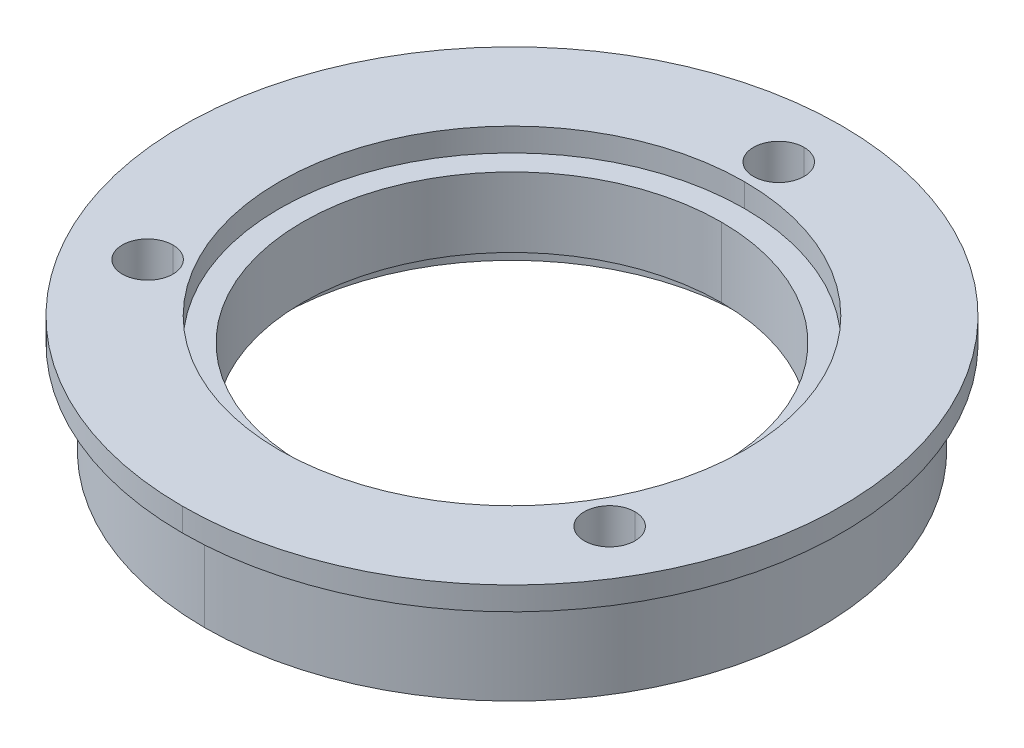
ISO-10303-21;
HEADER;
FILE_DESCRIPTION(('STEP AP214'),'2;1');
FILE_NAME('part.step','',(''),(''),'','','');
FILE_SCHEMA(('AUTOMOTIVE_DESIGN { 1 0 10303 214 1 1 1 1 }'));
ENDSEC;
DATA;
#1=APPLICATION_CONTEXT('core data for automotive mechanical design processes');
#2=APPLICATION_PROTOCOL_DEFINITION('international standard','automotive_design',2000,#1);
#3=PRODUCT_CONTEXT('',#1,'mechanical');
#4=PRODUCT('Part','Part','',(#3));
#5=PRODUCT_RELATED_PRODUCT_CATEGORY('part','',(#4));
#6=PRODUCT_DEFINITION_FORMATION('','',#4);
#7=PRODUCT_DEFINITION_CONTEXT('part definition',#1,'design');
#8=PRODUCT_DEFINITION('design','',#6,#7);
#9=PRODUCT_DEFINITION_SHAPE('','',#8);
#10=(LENGTH_UNIT() NAMED_UNIT(*) SI_UNIT(.MILLI.,.METRE.));
#11=(NAMED_UNIT(*) PLANE_ANGLE_UNIT() SI_UNIT($,.RADIAN.));
#12=(NAMED_UNIT(*) SI_UNIT($,.STERADIAN.) SOLID_ANGLE_UNIT());
#13=UNCERTAINTY_MEASURE_WITH_UNIT(LENGTH_MEASURE(1.E-05),#10,'distance_accuracy_value','');
#14=(GEOMETRIC_REPRESENTATION_CONTEXT(3) GLOBAL_UNCERTAINTY_ASSIGNED_CONTEXT((#13)) GLOBAL_UNIT_ASSIGNED_CONTEXT((#10,
#11,#12)) REPRESENTATION_CONTEXT('',''));
#15=CARTESIAN_POINT('',(0.,0.,0.));
#16=DIRECTION('',(0.,0.,1.));
#17=DIRECTION('',(1.,0.,0.));
#18=AXIS2_PLACEMENT_3D('',#15,#16,#17);
#19=CARTESIAN_POINT('',(15.7718814486414,3.96875,9.1059));
#20=DIRECTION('',(0.,1.,0.));
#21=DIRECTION('',(0.,0.,1.));
#22=AXIS2_PLACEMENT_3D('',#19,#20,#21);
#23=CYLINDRICAL_SURFACE('',#22,1.7272);
#24=DIRECTION('',(0.,1.,0.));
#25=VECTOR('',#24,1.);
#26=CARTESIAN_POINT('',(15.7718814486414,3.96875,7.3787));
#27=LINE('',#26,#25);
#28=CARTESIAN_POINT('',(15.7718814486414,-3.96875,7.3787));
#29=VERTEX_POINT('',#28);
#30=CARTESIAN_POINT('',(15.7718814486414,3.96875,7.3787));
#31=VERTEX_POINT('',#30);
#32=EDGE_CURVE('E228',#29,#31,#27,.T.);
#33=ORIENTED_EDGE('',*,*,#32,.F.);
#34=CARTESIAN_POINT('',(15.7718814486414,-3.96875,9.1059));
#35=DIRECTION('',(0.,1.,0.));
#36=DIRECTION('',(0.,0.,1.));
#37=AXIS2_PLACEMENT_3D('',#34,#35,#36);
#38=CIRCLE('',#37,1.7272);
#39=CARTESIAN_POINT('',(15.7718814486414,-3.96875,10.8331));
#40=VERTEX_POINT('',#39);
#41=EDGE_CURVE('E223',#40,#29,#38,.T.);
#42=ORIENTED_EDGE('',*,*,#41,.F.);
#43=DIRECTION('',(0.,1.,0.));
#44=VECTOR('',#43,1.);
#45=CARTESIAN_POINT('',(15.7718814486414,3.96875,10.8331));
#46=LINE('',#45,#44);
#47=CARTESIAN_POINT('',(15.7718814486414,3.96875,10.8331));
#48=VERTEX_POINT('',#47);
#49=EDGE_CURVE('E239',#40,#48,#46,.T.);
#50=ORIENTED_EDGE('',*,*,#49,.T.);
#51=CARTESIAN_POINT('',(15.7718814486414,3.96875,9.1059));
#52=DIRECTION('',(0.,1.,0.));
#53=DIRECTION('',(0.,0.,1.));
#54=AXIS2_PLACEMENT_3D('',#51,#52,#53);
#55=CIRCLE('',#54,1.7272);
#56=EDGE_CURVE('E220',#48,#31,#55,.T.);
#57=ORIENTED_EDGE('',*,*,#56,.T.);
#58=EDGE_LOOP('',(#33,#42,#50,#57));
#59=FACE_BOUND('',#58,.T.);
#60=ADVANCED_FACE('F16',(#59),#23,.F.);
#61=CARTESIAN_POINT('',(-15.7718814486414,3.96875,9.1059));
#62=DIRECTION('',(0.,1.,0.));
#63=DIRECTION('',(0.,0.,1.));
#64=AXIS2_PLACEMENT_3D('',#61,#62,#63);
#65=CYLINDRICAL_SURFACE('',#64,1.7272);
#66=DIRECTION('',(0.,1.,0.));
#67=VECTOR('',#66,1.);
#68=CARTESIAN_POINT('',(-15.7718814486414,3.96875,7.3787));
#69=LINE('',#68,#67);
#70=CARTESIAN_POINT('',(-15.7718814486414,-3.96875,7.3787));
#71=VERTEX_POINT('',#70);
#72=CARTESIAN_POINT('',(-15.7718814486414,3.96875,7.3787));
#73=VERTEX_POINT('',#72);
#74=EDGE_CURVE('E238',#71,#73,#69,.T.);
#75=ORIENTED_EDGE('',*,*,#74,.F.);
#76=CARTESIAN_POINT('',(-15.7718814486414,-3.96875,9.1059));
#77=DIRECTION('',(0.,1.,0.));
#78=DIRECTION('',(0.,0.,1.));
#79=AXIS2_PLACEMENT_3D('',#76,#77,#78);
#80=CIRCLE('',#79,1.7272);
#81=CARTESIAN_POINT('',(-15.7718814486414,-3.96875,10.8331));
#82=VERTEX_POINT('',#81);
#83=EDGE_CURVE('E208',#82,#71,#80,.T.);
#84=ORIENTED_EDGE('',*,*,#83,.F.);
#85=DIRECTION('',(0.,1.,0.));
#86=VECTOR('',#85,1.);
#87=CARTESIAN_POINT('',(-15.7718814486414,3.96875,10.8331));
#88=LINE('',#87,#86);
#89=CARTESIAN_POINT('',(-15.7718814486414,3.96875,10.8331));
#90=VERTEX_POINT('',#89);
#91=EDGE_CURVE('E315',#82,#90,#88,.T.);
#92=ORIENTED_EDGE('',*,*,#91,.T.);
#93=CARTESIAN_POINT('',(-15.7718814486414,3.96875,9.1059));
#94=DIRECTION('',(0.,1.,0.));
#95=DIRECTION('',(0.,0.,1.));
#96=AXIS2_PLACEMENT_3D('',#93,#94,#95);
#97=CIRCLE('',#96,1.7272);
#98=EDGE_CURVE('E327',#90,#73,#97,.T.);
#99=ORIENTED_EDGE('',*,*,#98,.T.);
#100=EDGE_LOOP('',(#75,#84,#92,#99));
#101=FACE_BOUND('',#100,.T.);
#102=ADVANCED_FACE('F364',(#101),#65,.F.);
#103=CARTESIAN_POINT('',(0.,3.96875,-18.2118));
#104=DIRECTION('',(0.,1.,0.));
#105=DIRECTION('',(0.,0.,1.));
#106=AXIS2_PLACEMENT_3D('',#103,#104,#105);
#107=CYLINDRICAL_SURFACE('',#106,1.7272);
#108=DIRECTION('',(0.,1.,0.));
#109=VECTOR('',#108,1.);
#110=CARTESIAN_POINT('',(0.,3.96875,-19.939));
#111=LINE('',#110,#109);
#112=CARTESIAN_POINT('',(0.,-3.96875,-19.939));
#113=VERTEX_POINT('',#112);
#114=CARTESIAN_POINT('',(0.,3.96875,-19.939));
#115=VERTEX_POINT('',#114);
#116=EDGE_CURVE('E214',#113,#115,#111,.T.);
#117=ORIENTED_EDGE('',*,*,#116,.F.);
#118=CARTESIAN_POINT('',(0.,-3.96875,-18.2118));
#119=DIRECTION('',(0.,1.,0.));
#120=DIRECTION('',(0.,0.,1.));
#121=AXIS2_PLACEMENT_3D('',#118,#119,#120);
#122=CIRCLE('',#121,1.7272);
#123=CARTESIAN_POINT('',(0.,-3.96875,-16.4846));
#124=VERTEX_POINT('',#123);
#125=EDGE_CURVE('E203',#124,#113,#122,.T.);
#126=ORIENTED_EDGE('',*,*,#125,.F.);
#127=DIRECTION('',(0.,1.,0.));
#128=VECTOR('',#127,1.);
#129=CARTESIAN_POINT('',(0.,3.96875,-16.4846));
#130=LINE('',#129,#128);
#131=CARTESIAN_POINT('',(0.,3.96875,-16.4846));
#132=VERTEX_POINT('',#131);
#133=EDGE_CURVE('E213',#124,#132,#130,.T.);
#134=ORIENTED_EDGE('',*,*,#133,.T.);
#135=CARTESIAN_POINT('',(0.,3.96875,-18.2118));
#136=DIRECTION('',(0.,1.,0.));
#137=DIRECTION('',(0.,0.,1.));
#138=AXIS2_PLACEMENT_3D('',#135,#136,#137);
#139=CIRCLE('',#138,1.7272);
#140=EDGE_CURVE('E257',#132,#115,#139,.T.);
#141=ORIENTED_EDGE('',*,*,#140,.T.);
#142=EDGE_LOOP('',(#117,#126,#134,#141));
#143=FACE_BOUND('',#142,.T.);
#144=ADVANCED_FACE('F370',(#143),#107,.F.);
#145=CARTESIAN_POINT('',(0.,-2.38125,0.));
#146=DIRECTION('',(0.,-1.,0.));
#147=DIRECTION('',(0.,0.,-1.));
#148=AXIS2_PLACEMENT_3D('',#145,#146,#147);
#149=PLANE('',#148);
#150=CARTESIAN_POINT('',(0.,-2.38125,0.));
#151=DIRECTION('',(0.,-1.,0.));
#152=DIRECTION('',(0.,0.,-1.));
#153=AXIS2_PLACEMENT_3D('',#150,#151,#152);
#154=CIRCLE('',#153,14.2875);
#155=CARTESIAN_POINT('',(0.,-2.38125,14.2875));
#156=VERTEX_POINT('',#155);
#157=CARTESIAN_POINT('',(0.,-2.38125,-14.2875));
#158=VERTEX_POINT('',#157);
#159=EDGE_CURVE('E184',#156,#158,#154,.T.);
#160=ORIENTED_EDGE('',*,*,#159,.F.);
#161=CARTESIAN_POINT('',(0.,-2.38125,0.));
#162=DIRECTION('',(0.,-1.,0.));
#163=DIRECTION('',(0.,0.,-1.));
#164=AXIS2_PLACEMENT_3D('',#161,#162,#163);
#165=CIRCLE('',#164,14.2875);
#166=EDGE_CURVE('E170',#158,#156,#165,.T.);
#167=ORIENTED_EDGE('',*,*,#166,.F.);
#168=EDGE_LOOP('',(#160,#167));
#169=FACE_BOUND('',#168,.T.);
#170=CARTESIAN_POINT('',(0.,-2.38125,0.));
#171=DIRECTION('',(0.,1.,0.));
#172=DIRECTION('',(0.,0.,1.));
#173=AXIS2_PLACEMENT_3D('',#170,#171,#172);
#174=CIRCLE('',#173,15.875);
#175=CARTESIAN_POINT('',(0.,-2.38125,-15.875));
#176=VERTEX_POINT('',#175);
#177=CARTESIAN_POINT('',(0.,-2.38125,15.875));
#178=VERTEX_POINT('',#177);
#179=EDGE_CURVE('E267',#176,#178,#174,.T.);
#180=ORIENTED_EDGE('',*,*,#179,.F.);
#181=CARTESIAN_POINT('',(0.,-2.38125,0.));
#182=DIRECTION('',(0.,1.,0.));
#183=DIRECTION('',(0.,0.,1.));
#184=AXIS2_PLACEMENT_3D('',#181,#182,#183);
#185=CIRCLE('',#184,15.875);
#186=EDGE_CURVE('E11',#178,#176,#185,.T.);
#187=ORIENTED_EDGE('',*,*,#186,.F.);
#188=EDGE_LOOP('',(#180,#187));
#189=FACE_BOUND('',#188,.T.);
#190=ADVANCED_FACE('F188',(#169,#189),#149,.T.);
#191=CARTESIAN_POINT('',(0.,-2.38125,0.));
#192=DIRECTION('',(0.,-1.,0.));
#193=DIRECTION('',(0.,0.,-1.));
#194=AXIS2_PLACEMENT_3D('',#191,#192,#193);
#195=CYLINDRICAL_SURFACE('',#194,15.875);
#196=DIRECTION('',(0.,-1.,0.));
#197=VECTOR('',#196,1.);
#198=CARTESIAN_POINT('',(0.,-2.38125,15.875));
#199=LINE('',#198,#197);
#200=CARTESIAN_POINT('',(0.,-3.96875,15.875));
#201=VERTEX_POINT('',#200);
#202=EDGE_CURVE('E263',#178,#201,#199,.T.);
#203=ORIENTED_EDGE('',*,*,#202,.F.);
#204=ORIENTED_EDGE('',*,*,#186,.T.);
#205=DIRECTION('',(0.,-1.,0.));
#206=VECTOR('',#205,1.);
#207=CARTESIAN_POINT('',(0.,-2.38125,-15.875));
#208=LINE('',#207,#206);
#209=CARTESIAN_POINT('',(0.,-3.96875,-15.875));
#210=VERTEX_POINT('',#209);
#211=EDGE_CURVE('E262',#176,#210,#208,.T.);
#212=ORIENTED_EDGE('',*,*,#211,.T.);
#213=CARTESIAN_POINT('',(0.,-3.96875,0.));
#214=DIRECTION('',(0.,1.,0.));
#215=DIRECTION('',(0.,0.,1.));
#216=AXIS2_PLACEMENT_3D('',#213,#214,#215);
#217=CIRCLE('',#216,15.875);
#218=EDGE_CURVE('E207',#201,#210,#217,.T.);
#219=ORIENTED_EDGE('',*,*,#218,.F.);
#220=EDGE_LOOP('',(#203,#204,#212,#219));
#221=FACE_BOUND('',#220,.T.);
#222=ADVANCED_FACE('F402',(#221),#195,.F.);
#223=CARTESIAN_POINT('',(0.,2.38125,0.));
#224=DIRECTION('',(0.,1.,0.));
#225=DIRECTION('',(1.,0.,0.));
#226=AXIS2_PLACEMENT_3D('',#223,#224,#225);
#227=PLANE('',#226);
#228=CARTESIAN_POINT('',(0.,2.38125,0.));
#229=DIRECTION('',(0.,1.,0.));
#230=DIRECTION('',(0.,0.,1.));
#231=AXIS2_PLACEMENT_3D('',#228,#229,#230);
#232=CIRCLE('',#231,14.2875);
#233=CARTESIAN_POINT('',(0.,2.38125,14.2875));
#234=VERTEX_POINT('',#233);
#235=CARTESIAN_POINT('',(0.,2.38125,-14.2875));
#236=VERTEX_POINT('',#235);
#237=EDGE_CURVE('E40',#234,#236,#232,.T.);
#238=ORIENTED_EDGE('',*,*,#237,.F.);
#239=CARTESIAN_POINT('',(0.,2.38125,0.));
#240=DIRECTION('',(0.,1.,0.));
#241=DIRECTION('',(0.,0.,1.));
#242=AXIS2_PLACEMENT_3D('',#239,#240,#241);
#243=CIRCLE('',#242,14.2875);
#244=EDGE_CURVE('E185',#236,#234,#243,.T.);
#245=ORIENTED_EDGE('',*,*,#244,.F.);
#246=EDGE_LOOP('',(#238,#245));
#247=FACE_BOUND('',#246,.T.);
#248=CARTESIAN_POINT('',(0.,2.38125,0.));
#249=DIRECTION('',(0.,1.,0.));
#250=DIRECTION('',(0.,0.,1.));
#251=AXIS2_PLACEMENT_3D('',#248,#249,#250);
#252=CIRCLE('',#251,15.875);
#253=CARTESIAN_POINT('',(0.,2.38125,15.875));
#254=VERTEX_POINT('',#253);
#255=CARTESIAN_POINT('',(0.,2.38125,-15.875));
#256=VERTEX_POINT('',#255);
#257=EDGE_CURVE('E27',#254,#256,#252,.T.);
#258=ORIENTED_EDGE('',*,*,#257,.T.);
#259=CARTESIAN_POINT('',(0.,2.38125,0.));
#260=DIRECTION('',(0.,1.,0.));
#261=DIRECTION('',(0.,0.,1.));
#262=AXIS2_PLACEMENT_3D('',#259,#260,#261);
#263=CIRCLE('',#262,15.875);
#264=EDGE_CURVE('E276',#256,#254,#263,.T.);
#265=ORIENTED_EDGE('',*,*,#264,.T.);
#266=EDGE_LOOP('',(#258,#265));
#267=FACE_BOUND('',#266,.T.);
#268=ADVANCED_FACE('F380',(#247,#267),#227,.T.);
#269=CARTESIAN_POINT('',(0.,2.38125,0.));
#270=DIRECTION('',(0.,1.,0.));
#271=DIRECTION('',(0.,0.,1.));
#272=AXIS2_PLACEMENT_3D('',#269,#270,#271);
#273=CYLINDRICAL_SURFACE('',#272,15.875);
#274=DIRECTION('',(0.,1.,0.));
#275=VECTOR('',#274,1.);
#276=CARTESIAN_POINT('',(0.,2.38125,-15.875));
#277=LINE('',#276,#275);
#278=CARTESIAN_POINT('',(0.,3.96875,-15.875));
#279=VERTEX_POINT('',#278);
#280=EDGE_CURVE('E252',#256,#279,#277,.T.);
#281=ORIENTED_EDGE('',*,*,#280,.F.);
#282=ORIENTED_EDGE('',*,*,#257,.F.);
#283=DIRECTION('',(0.,1.,0.));
#284=VECTOR('',#283,1.);
#285=CARTESIAN_POINT('',(0.,2.38125,15.875));
#286=LINE('',#285,#284);
#287=CARTESIAN_POINT('',(0.,3.96875,15.875));
#288=VERTEX_POINT('',#287);
#289=EDGE_CURVE('E251',#254,#288,#286,.T.);
#290=ORIENTED_EDGE('',*,*,#289,.T.);
#291=CARTESIAN_POINT('',(0.,3.96875,0.));
#292=DIRECTION('',(0.,1.,0.));
#293=DIRECTION('',(0.,0.,1.));
#294=AXIS2_PLACEMENT_3D('',#291,#292,#293);
#295=CIRCLE('',#294,15.875);
#296=EDGE_CURVE('E253',#288,#279,#295,.T.);
#297=ORIENTED_EDGE('',*,*,#296,.T.);
#298=EDGE_LOOP('',(#281,#282,#290,#297));
#299=FACE_BOUND('',#298,.T.);
#300=ADVANCED_FACE('F377',(#299),#273,.F.);
#301=CARTESIAN_POINT('',(0.,3.96875,0.));
#302=DIRECTION('',(0.,1.,0.));
#303=DIRECTION('',(0.,0.,1.));
#304=AXIS2_PLACEMENT_3D('',#301,#302,#303);
#305=CYLINDRICAL_SURFACE('',#304,22.5);
#306=DIRECTION('',(0.,1.,0.));
#307=VECTOR('',#306,1.);
#308=CARTESIAN_POINT('',(0.,3.96875,-22.5));
#309=LINE('',#308,#307);
#310=CARTESIAN_POINT('',(0.,2.38125,-22.5));
#311=VERTEX_POINT('',#310);
#312=CARTESIAN_POINT('',(0.,3.96875,-22.5));
#313=VERTEX_POINT('',#312);
#314=EDGE_CURVE('E305',#311,#313,#309,.T.);
#315=ORIENTED_EDGE('',*,*,#314,.F.);
#316=CARTESIAN_POINT('',(0.,2.38125,0.));
#317=DIRECTION('',(0.,1.,0.));
#318=DIRECTION('',(0.,0.,1.));
#319=AXIS2_PLACEMENT_3D('',#316,#317,#318);
#320=CIRCLE('',#319,22.5);
#321=CARTESIAN_POINT('',(0.,2.38125,22.5));
#322=VERTEX_POINT('',#321);
#323=EDGE_CURVE('E224',#311,#322,#320,.T.);
#324=ORIENTED_EDGE('',*,*,#323,.T.);
#325=DIRECTION('',(0.,1.,0.));
#326=VECTOR('',#325,1.);
#327=CARTESIAN_POINT('',(0.,3.96875,22.5));
#328=LINE('',#327,#326);
#329=CARTESIAN_POINT('',(0.,3.96875,22.5));
#330=VERTEX_POINT('',#329);
#331=EDGE_CURVE('E288',#322,#330,#328,.T.);
#332=ORIENTED_EDGE('',*,*,#331,.T.);
#333=CARTESIAN_POINT('',(0.,3.96875,0.));
#334=DIRECTION('',(0.,1.,0.));
#335=DIRECTION('',(0.,0.,1.));
#336=AXIS2_PLACEMENT_3D('',#333,#334,#335);
#337=CIRCLE('',#336,22.5);
#338=EDGE_CURVE('E217',#313,#330,#337,.T.);
#339=ORIENTED_EDGE('',*,*,#338,.F.);
#340=EDGE_LOOP('',(#315,#324,#332,#339));
#341=FACE_BOUND('',#340,.T.);
#342=ADVANCED_FACE('F344',(#341),#305,.T.);
#343=CARTESIAN_POINT('',(-22.5,2.38125,0.));
#344=DIRECTION('',(0.,-1.,0.));
#345=DIRECTION('',(0.,0.,-1.));
#346=AXIS2_PLACEMENT_3D('',#343,#344,#345);
#347=PLANE('',#346);
#348=CARTESIAN_POINT('',(0.,2.38125,0.));
#349=DIRECTION('',(0.,1.,0.));
#350=DIRECTION('',(0.,0.,1.));
#351=AXIS2_PLACEMENT_3D('',#348,#349,#350);
#352=CIRCLE('',#351,20.987300037);
#353=CARTESIAN_POINT('',(0.,2.38125,20.987300037));
#354=VERTEX_POINT('',#353);
#355=CARTESIAN_POINT('',(0.,2.38125,-20.987300037));
#356=VERTEX_POINT('',#355);
#357=EDGE_CURVE('E200',#354,#356,#352,.T.);
#358=ORIENTED_EDGE('',*,*,#357,.T.);
#359=CARTESIAN_POINT('',(0.,2.38125,0.));
#360=DIRECTION('',(0.,1.,0.));
#361=DIRECTION('',(0.,0.,1.));
#362=AXIS2_PLACEMENT_3D('',#359,#360,#361);
#363=CIRCLE('',#362,20.987300037);
#364=EDGE_CURVE('E227',#356,#354,#363,.T.);
#365=ORIENTED_EDGE('',*,*,#364,.T.);
#366=EDGE_LOOP('',(#358,#365));
#367=FACE_BOUND('',#366,.T.);
#368=CARTESIAN_POINT('',(0.,2.38125,0.));
#369=DIRECTION('',(0.,1.,0.));
#370=DIRECTION('',(0.,0.,1.));
#371=AXIS2_PLACEMENT_3D('',#368,#369,#370);
#372=CIRCLE('',#371,22.5);
#373=EDGE_CURVE('E323',#322,#311,#372,.T.);
#374=ORIENTED_EDGE('',*,*,#373,.F.);
#375=ORIENTED_EDGE('',*,*,#323,.F.);
#376=EDGE_LOOP('',(#374,#375));
#377=FACE_BOUND('',#376,.T.);
#378=ADVANCED_FACE('F343',(#367,#377),#347,.T.);
#379=CARTESIAN_POINT('',(0.,3.96875,0.));
#380=DIRECTION('',(0.,1.,0.));
#381=DIRECTION('',(0.,0.,1.));
#382=AXIS2_PLACEMENT_3D('',#379,#380,#381);
#383=CYLINDRICAL_SURFACE('',#382,20.987300037);
#384=DIRECTION('',(0.,1.,0.));
#385=VECTOR('',#384,1.);
#386=CARTESIAN_POINT('',(0.,3.96875,-20.987300037));
#387=LINE('',#386,#385);
#388=CARTESIAN_POINT('',(0.,-3.96875,-20.987300037));
#389=VERTEX_POINT('',#388);
#390=EDGE_CURVE('E268',#389,#356,#387,.T.);
#391=ORIENTED_EDGE('',*,*,#390,.F.);
#392=CARTESIAN_POINT('',(0.,-3.96875,0.));
#393=DIRECTION('',(0.,1.,0.));
#394=DIRECTION('',(0.,0.,1.));
#395=AXIS2_PLACEMENT_3D('',#392,#393,#394);
#396=CIRCLE('',#395,20.987300037);
#397=CARTESIAN_POINT('',(0.,-3.96875,20.987300037));
#398=VERTEX_POINT('',#397);
#399=EDGE_CURVE('E256',#389,#398,#396,.T.);
#400=ORIENTED_EDGE('',*,*,#399,.T.);
#401=DIRECTION('',(0.,1.,0.));
#402=VECTOR('',#401,1.);
#403=CARTESIAN_POINT('',(0.,3.96875,20.987300037));
#404=LINE('',#403,#402);
#405=EDGE_CURVE('E191',#398,#354,#404,.T.);
#406=ORIENTED_EDGE('',*,*,#405,.T.);
#407=ORIENTED_EDGE('',*,*,#364,.F.);
#408=EDGE_LOOP('',(#391,#400,#406,#407));
#409=FACE_BOUND('',#408,.T.);
#410=ADVANCED_FACE('F357',(#409),#383,.T.);
#411=CARTESIAN_POINT('',(-14.2875,-3.96875,0.));
#412=DIRECTION('',(0.,-1.,0.));
#413=DIRECTION('',(0.,0.,-1.));
#414=AXIS2_PLACEMENT_3D('',#411,#412,#413);
#415=PLANE('',#414);
#416=CARTESIAN_POINT('',(0.,-3.96875,0.));
#417=DIRECTION('',(0.,1.,0.));
#418=DIRECTION('',(0.,0.,1.));
#419=AXIS2_PLACEMENT_3D('',#416,#417,#418);
#420=CIRCLE('',#419,15.875);
#421=EDGE_CURVE('E258',#210,#201,#420,.T.);
#422=ORIENTED_EDGE('',*,*,#421,.T.);
#423=ORIENTED_EDGE('',*,*,#218,.T.);
#424=EDGE_LOOP('',(#422,#423));
#425=FACE_BOUND('',#424,.T.);
#426=ORIENTED_EDGE('',*,*,#125,.T.);
#427=CARTESIAN_POINT('',(0.,-3.96875,-18.2118));
#428=DIRECTION('',(0.,1.,0.));
#429=DIRECTION('',(0.,0.,1.));
#430=AXIS2_PLACEMENT_3D('',#427,#428,#429);
#431=CIRCLE('',#430,1.7272);
#432=EDGE_CURVE('E246',#113,#124,#431,.T.);
#433=ORIENTED_EDGE('',*,*,#432,.T.);
#434=EDGE_LOOP('',(#426,#433));
#435=FACE_BOUND('',#434,.T.);
#436=ORIENTED_EDGE('',*,*,#83,.T.);
#437=CARTESIAN_POINT('',(-15.7718814486414,-3.96875,9.1059));
#438=DIRECTION('',(0.,1.,0.));
#439=DIRECTION('',(0.,0.,1.));
#440=AXIS2_PLACEMENT_3D('',#437,#438,#439);
#441=CIRCLE('',#440,1.7272);
#442=EDGE_CURVE('E234',#71,#82,#441,.T.);
#443=ORIENTED_EDGE('',*,*,#442,.T.);
#444=EDGE_LOOP('',(#436,#443));
#445=FACE_BOUND('',#444,.T.);
#446=ORIENTED_EDGE('',*,*,#41,.T.);
#447=CARTESIAN_POINT('',(15.7718814486414,-3.96875,9.1059));
#448=DIRECTION('',(0.,1.,0.));
#449=DIRECTION('',(0.,0.,1.));
#450=AXIS2_PLACEMENT_3D('',#447,#448,#449);
#451=CIRCLE('',#450,1.7272);
#452=EDGE_CURVE('E233',#29,#40,#451,.T.);
#453=ORIENTED_EDGE('',*,*,#452,.T.);
#454=EDGE_LOOP('',(#446,#453));
#455=FACE_BOUND('',#454,.T.);
#456=CARTESIAN_POINT('',(0.,-3.96875,0.));
#457=DIRECTION('',(0.,1.,0.));
#458=DIRECTION('',(0.,0.,1.));
#459=AXIS2_PLACEMENT_3D('',#456,#457,#458);
#460=CIRCLE('',#459,20.987300037);
#461=EDGE_CURVE('E272',#398,#389,#460,.T.);
#462=ORIENTED_EDGE('',*,*,#461,.F.);
#463=ORIENTED_EDGE('',*,*,#399,.F.);
#464=EDGE_LOOP('',(#462,#463));
#465=FACE_BOUND('',#464,.T.);
#466=ADVANCED_FACE('F348',(#425,#435,#445,#455,#465),#415,.T.);
#467=CARTESIAN_POINT('',(-22.5,3.96875,0.));
#468=DIRECTION('',(0.,1.,0.));
#469=DIRECTION('',(1.,0.,0.));
#470=AXIS2_PLACEMENT_3D('',#467,#468,#469);
#471=PLANE('',#470);
#472=ORIENTED_EDGE('',*,*,#296,.F.);
#473=CARTESIAN_POINT('',(0.,3.96875,0.));
#474=DIRECTION('',(0.,1.,0.));
#475=DIRECTION('',(0.,0.,1.));
#476=AXIS2_PLACEMENT_3D('',#473,#474,#475);
#477=CIRCLE('',#476,15.875);
#478=EDGE_CURVE('E247',#279,#288,#477,.T.);
#479=ORIENTED_EDGE('',*,*,#478,.F.);
#480=EDGE_LOOP('',(#472,#479));
#481=FACE_BOUND('',#480,.T.);
#482=ORIENTED_EDGE('',*,*,#140,.F.);
#483=CARTESIAN_POINT('',(0.,3.96875,-18.2118));
#484=DIRECTION('',(0.,1.,0.));
#485=DIRECTION('',(0.,0.,1.));
#486=AXIS2_PLACEMENT_3D('',#483,#484,#485);
#487=CIRCLE('',#486,1.7272);
#488=EDGE_CURVE('E209',#115,#132,#487,.T.);
#489=ORIENTED_EDGE('',*,*,#488,.F.);
#490=EDGE_LOOP('',(#482,#489));
#491=FACE_BOUND('',#490,.T.);
#492=ORIENTED_EDGE('',*,*,#98,.F.);
#493=CARTESIAN_POINT('',(-15.7718814486414,3.96875,9.1059));
#494=DIRECTION('',(0.,1.,0.));
#495=DIRECTION('',(0.,0.,1.));
#496=AXIS2_PLACEMENT_3D('',#493,#494,#495);
#497=CIRCLE('',#496,1.7272);
#498=EDGE_CURVE('E20',#73,#90,#497,.T.);
#499=ORIENTED_EDGE('',*,*,#498,.F.);
#500=EDGE_LOOP('',(#492,#499));
#501=FACE_BOUND('',#500,.T.);
#502=ORIENTED_EDGE('',*,*,#56,.F.);
#503=CARTESIAN_POINT('',(15.7718814486414,3.96875,9.1059));
#504=DIRECTION('',(0.,1.,0.));
#505=DIRECTION('',(0.,0.,1.));
#506=AXIS2_PLACEMENT_3D('',#503,#504,#505);
#507=CIRCLE('',#506,1.7272);
#508=EDGE_CURVE('E232',#31,#48,#507,.T.);
#509=ORIENTED_EDGE('',*,*,#508,.F.);
#510=EDGE_LOOP('',(#502,#509));
#511=FACE_BOUND('',#510,.T.);
#512=CARTESIAN_POINT('',(0.,3.96875,0.));
#513=DIRECTION('',(0.,1.,0.));
#514=DIRECTION('',(0.,0.,1.));
#515=AXIS2_PLACEMENT_3D('',#512,#513,#514);
#516=CIRCLE('',#515,22.5);
#517=EDGE_CURVE('E296',#330,#313,#516,.T.);
#518=ORIENTED_EDGE('',*,*,#517,.T.);
#519=ORIENTED_EDGE('',*,*,#338,.T.);
#520=EDGE_LOOP('',(#518,#519));
#521=FACE_BOUND('',#520,.T.);
#522=ADVANCED_FACE('F346',(#481,#491,#501,#511,#521),#471,.T.);
#523=CARTESIAN_POINT('',(0.,3.96875,0.));
#524=DIRECTION('',(0.,1.,0.));
#525=DIRECTION('',(0.,0.,1.));
#526=AXIS2_PLACEMENT_3D('',#523,#524,#525);
#527=CYLINDRICAL_SURFACE('',#526,14.2875);
#528=DIRECTION('',(0.,1.,0.));
#529=VECTOR('',#528,1.);
#530=CARTESIAN_POINT('',(0.,3.96875,-14.2875));
#531=LINE('',#530,#529);
#532=EDGE_CURVE('E176',#158,#236,#531,.T.);
#533=ORIENTED_EDGE('',*,*,#532,.F.);
#534=ORIENTED_EDGE('',*,*,#166,.T.);
#535=DIRECTION('',(0.,1.,0.));
#536=VECTOR('',#535,1.);
#537=CARTESIAN_POINT('',(0.,3.96875,14.2875));
#538=LINE('',#537,#536);
#539=EDGE_CURVE('E173',#156,#234,#538,.T.);
#540=ORIENTED_EDGE('',*,*,#539,.T.);
#541=ORIENTED_EDGE('',*,*,#237,.T.);
#542=EDGE_LOOP('',(#533,#534,#540,#541));
#543=FACE_BOUND('',#542,.T.);
#544=ADVANCED_FACE('F172',(#543),#527,.F.);
#545=CARTESIAN_POINT('',(0.,3.96875,0.));
#546=DIRECTION('',(0.,1.,0.));
#547=DIRECTION('',(0.,0.,1.));
#548=AXIS2_PLACEMENT_3D('',#545,#546,#547);
#549=CYLINDRICAL_SURFACE('',#548,14.2875);
#550=ORIENTED_EDGE('',*,*,#159,.T.);
#551=ORIENTED_EDGE('',*,*,#532,.T.);
#552=ORIENTED_EDGE('',*,*,#244,.T.);
#553=ORIENTED_EDGE('',*,*,#539,.F.);
#554=EDGE_LOOP('',(#550,#551,#552,#553));
#555=FACE_BOUND('',#554,.T.);
#556=ADVANCED_FACE('F183',(#555),#549,.F.);
#557=CARTESIAN_POINT('',(0.,3.96875,0.));
#558=DIRECTION('',(0.,1.,0.));
#559=DIRECTION('',(0.,0.,1.));
#560=AXIS2_PLACEMENT_3D('',#557,#558,#559);
#561=CYLINDRICAL_SURFACE('',#560,20.987300037);
#562=ORIENTED_EDGE('',*,*,#461,.T.);
#563=ORIENTED_EDGE('',*,*,#390,.T.);
#564=ORIENTED_EDGE('',*,*,#357,.F.);
#565=ORIENTED_EDGE('',*,*,#405,.F.);
#566=EDGE_LOOP('',(#562,#563,#564,#565));
#567=FACE_BOUND('',#566,.T.);
#568=ADVANCED_FACE('F389',(#567),#561,.T.);
#569=CARTESIAN_POINT('',(0.,3.96875,0.));
#570=DIRECTION('',(0.,1.,0.));
#571=DIRECTION('',(0.,0.,1.));
#572=AXIS2_PLACEMENT_3D('',#569,#570,#571);
#573=CYLINDRICAL_SURFACE('',#572,22.5);
#574=ORIENTED_EDGE('',*,*,#373,.T.);
#575=ORIENTED_EDGE('',*,*,#314,.T.);
#576=ORIENTED_EDGE('',*,*,#517,.F.);
#577=ORIENTED_EDGE('',*,*,#331,.F.);
#578=EDGE_LOOP('',(#574,#575,#576,#577));
#579=FACE_BOUND('',#578,.T.);
#580=ADVANCED_FACE('F340',(#579),#573,.T.);
#581=CARTESIAN_POINT('',(0.,2.38125,0.));
#582=DIRECTION('',(0.,1.,0.));
#583=DIRECTION('',(0.,0.,1.));
#584=AXIS2_PLACEMENT_3D('',#581,#582,#583);
#585=CYLINDRICAL_SURFACE('',#584,15.875);
#586=ORIENTED_EDGE('',*,*,#264,.F.);
#587=ORIENTED_EDGE('',*,*,#280,.T.);
#588=ORIENTED_EDGE('',*,*,#478,.T.);
#589=ORIENTED_EDGE('',*,*,#289,.F.);
#590=EDGE_LOOP('',(#586,#587,#588,#589));
#591=FACE_BOUND('',#590,.T.);
#592=ADVANCED_FACE('F388',(#591),#585,.F.);
#593=CARTESIAN_POINT('',(0.,-2.38125,0.));
#594=DIRECTION('',(0.,-1.,0.));
#595=DIRECTION('',(0.,0.,-1.));
#596=AXIS2_PLACEMENT_3D('',#593,#594,#595);
#597=CYLINDRICAL_SURFACE('',#596,15.875);
#598=ORIENTED_EDGE('',*,*,#179,.T.);
#599=ORIENTED_EDGE('',*,*,#202,.T.);
#600=ORIENTED_EDGE('',*,*,#421,.F.);
#601=ORIENTED_EDGE('',*,*,#211,.F.);
#602=EDGE_LOOP('',(#598,#599,#600,#601));
#603=FACE_BOUND('',#602,.T.);
#604=ADVANCED_FACE('F392',(#603),#597,.F.);
#605=CARTESIAN_POINT('',(0.,3.96875,-18.2118));
#606=DIRECTION('',(0.,1.,0.));
#607=DIRECTION('',(0.,0.,1.));
#608=AXIS2_PLACEMENT_3D('',#605,#606,#607);
#609=CYLINDRICAL_SURFACE('',#608,1.7272);
#610=ORIENTED_EDGE('',*,*,#432,.F.);
#611=ORIENTED_EDGE('',*,*,#116,.T.);
#612=ORIENTED_EDGE('',*,*,#488,.T.);
#613=ORIENTED_EDGE('',*,*,#133,.F.);
#614=EDGE_LOOP('',(#610,#611,#612,#613));
#615=FACE_BOUND('',#614,.T.);
#616=ADVANCED_FACE('F384',(#615),#609,.F.);
#617=CARTESIAN_POINT('',(-15.7718814486414,3.96875,9.1059));
#618=DIRECTION('',(0.,1.,0.));
#619=DIRECTION('',(0.,0.,1.));
#620=AXIS2_PLACEMENT_3D('',#617,#618,#619);
#621=CYLINDRICAL_SURFACE('',#620,1.7272);
#622=ORIENTED_EDGE('',*,*,#442,.F.);
#623=ORIENTED_EDGE('',*,*,#74,.T.);
#624=ORIENTED_EDGE('',*,*,#498,.T.);
#625=ORIENTED_EDGE('',*,*,#91,.F.);
#626=EDGE_LOOP('',(#622,#623,#624,#625));
#627=FACE_BOUND('',#626,.T.);
#628=ADVANCED_FACE('F381',(#627),#621,.F.);
#629=CARTESIAN_POINT('',(15.7718814486414,3.96875,9.1059));
#630=DIRECTION('',(0.,1.,0.));
#631=DIRECTION('',(0.,0.,1.));
#632=AXIS2_PLACEMENT_3D('',#629,#630,#631);
#633=CYLINDRICAL_SURFACE('',#632,1.7272);
#634=ORIENTED_EDGE('',*,*,#452,.F.);
#635=ORIENTED_EDGE('',*,*,#32,.T.);
#636=ORIENTED_EDGE('',*,*,#508,.T.);
#637=ORIENTED_EDGE('',*,*,#49,.F.);
#638=EDGE_LOOP('',(#634,#635,#636,#637));
#639=FACE_BOUND('',#638,.T.);
#640=ADVANCED_FACE('F18',(#639),#633,.F.);
#641=CLOSED_SHELL('',(#60,#102,#144,#190,#222,#268,#300,#342,#378,#410,#466,#522,#544,#556,#568,
#580,#592,#604,#616,#628,#640));
#642=MANIFOLD_SOLID_BREP('B1',#641);
#643=ADVANCED_BREP_SHAPE_REPRESENTATION('',(#18,#642),#14);
#644=SHAPE_DEFINITION_REPRESENTATION(#9,#643);
ENDSEC;
END-ISO-10303-21;
